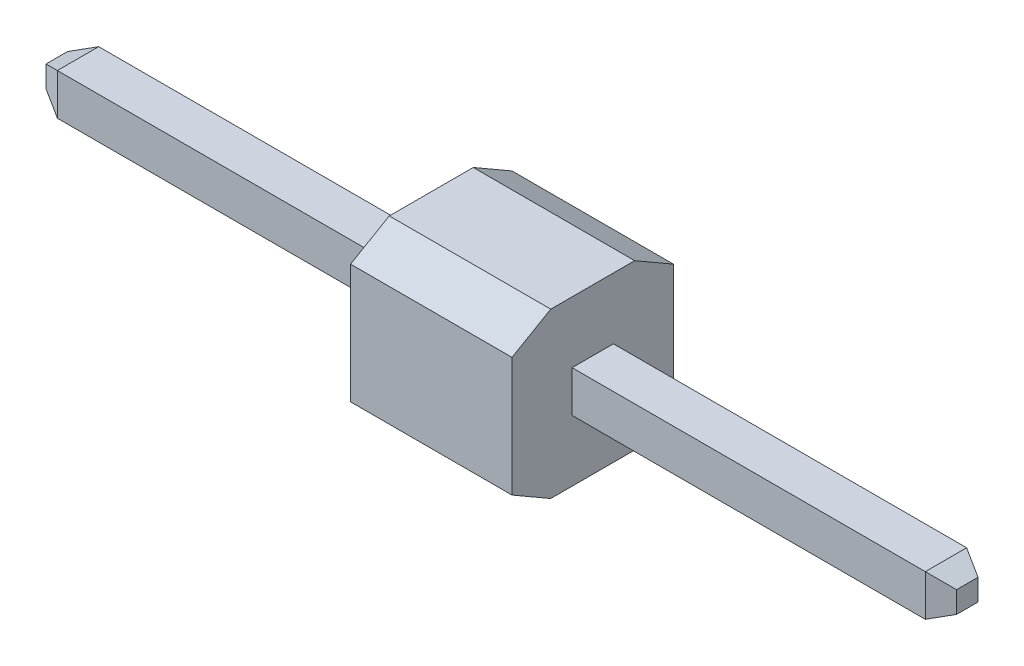
ISO-10303-21;
HEADER;
FILE_DESCRIPTION(('STEP AP214'),'2;1');
FILE_NAME('part.step','',(''),(''),'','','');
FILE_SCHEMA(('AUTOMOTIVE_DESIGN { 1 0 10303 214 1 1 1 1 }'));
ENDSEC;
DATA;
#1=APPLICATION_CONTEXT('core data for automotive mechanical design processes');
#2=APPLICATION_PROTOCOL_DEFINITION('international standard','automotive_design',2000,#1);
#3=PRODUCT_CONTEXT('',#1,'mechanical');
#4=PRODUCT('Part','Part','',(#3));
#5=PRODUCT_RELATED_PRODUCT_CATEGORY('part','',(#4));
#6=PRODUCT_DEFINITION_FORMATION('','',#4);
#7=PRODUCT_DEFINITION_CONTEXT('part definition',#1,'design');
#8=PRODUCT_DEFINITION('design','',#6,#7);
#9=PRODUCT_DEFINITION_SHAPE('','',#8);
#10=(LENGTH_UNIT() NAMED_UNIT(*) SI_UNIT(.MILLI.,.METRE.));
#11=(NAMED_UNIT(*) PLANE_ANGLE_UNIT() SI_UNIT($,.RADIAN.));
#12=(NAMED_UNIT(*) SI_UNIT($,.STERADIAN.) SOLID_ANGLE_UNIT());
#13=UNCERTAINTY_MEASURE_WITH_UNIT(LENGTH_MEASURE(1.E-05),#10,'distance_accuracy_value','');
#14=(GEOMETRIC_REPRESENTATION_CONTEXT(3) GLOBAL_UNCERTAINTY_ASSIGNED_CONTEXT((#13)) GLOBAL_UNIT_ASSIGNED_CONTEXT((#10,
#11,#12)) REPRESENTATION_CONTEXT('',''));
#15=CARTESIAN_POINT('',(0.,0.,0.));
#16=DIRECTION('',(0.,0.,1.));
#17=DIRECTION('',(1.,0.,0.));
#18=AXIS2_PLACEMENT_3D('',#15,#16,#17);
#19=CARTESIAN_POINT('',(5.421049816933,7.30287173708609,0.629998634255617));
#20=DIRECTION('',(1.,4.37113882867379E-08,-4.37113882867379E-08));
#21=DIRECTION('',(-4.37113882867379E-08,1.,0.));
#22=AXIS2_PLACEMENT_3D('',#19,#20,#21);
#23=PLANE('',#22);
#24=DIRECTION('',(1.59994790123753E-08,0.50000000000019,0.866025403784329));
#25=VECTOR('',#24,1.);
#26=CARTESIAN_POINT('',(5.42104969394708,8.54646157557208,-0.940001365744382));
#27=LINE('',#26,#25);
#28=CARTESIAN_POINT('',(5.42104969394708,8.54646157557208,-0.940001365744382));
#29=VERTEX_POINT('',#28);
#30=CARTESIAN_POINT('',(5.42104970503185,8.89287173708609,-0.340001365744383));
#31=VERTEX_POINT('',#30);
#32=EDGE_CURVE('E11',#29,#31,#27,.T.);
#33=ORIENTED_EDGE('',*,*,#32,.T.);
#34=DIRECTION('',(4.37113886966664E-08,0.,0.999999999999999));
#35=VECTOR('',#34,1.);
#36=CARTESIAN_POINT('',(5.42104970503185,8.89287173708609,-0.340001365744383));
#37=LINE('',#36,#35);
#38=CARTESIAN_POINT('',(5.42104976185665,8.89287173708609,0.959998634255618));
#39=VERTEX_POINT('',#38);
#40=EDGE_CURVE('E304',#31,#39,#37,.T.);
#41=ORIENTED_EDGE('',*,*,#40,.T.);
#42=DIRECTION('',(5.97108656004285E-08,-0.500000000000188,0.866025403784328));
#43=VECTOR('',#42,1.);
#44=CARTESIAN_POINT('',(5.42104976185665,8.89287173708609,0.959998634255618));
#45=LINE('',#44,#43);
#46=CARTESIAN_POINT('',(5.42104980322556,8.54646157557209,1.55999863425562));
#47=VERTEX_POINT('',#46);
#48=EDGE_CURVE('E296',#39,#47,#45,.T.);
#49=ORIENTED_EDGE('',*,*,#48,.T.);
#50=DIRECTION('',(4.37113884815072E-08,-0.999999999999999,0.));
#51=VECTOR('',#50,1.);
#52=CARTESIAN_POINT('',(5.42104980322556,8.54646157557209,1.55999863425562));
#53=LINE('',#52,#51);
#54=CARTESIAN_POINT('',(5.42104988396834,6.69928189860009,1.55999863425562));
#55=VERTEX_POINT('',#54);
#56=EDGE_CURVE('E281',#47,#55,#53,.T.);
#57=ORIENTED_EDGE('',*,*,#56,.T.);
#58=DIRECTION('',(1.59994777304001E-08,0.500000000000191,0.866025403784328));
#59=VECTOR('',#58,1.);
#60=CARTESIAN_POINT('',(5.42104987288358,6.35287173708609,0.959998634255618));
#61=LINE('',#60,#59);
#62=CARTESIAN_POINT('',(5.42104987288358,6.35287173708609,0.959998634255618));
#63=VERTEX_POINT('',#62);
#64=EDGE_CURVE('E265',#63,#55,#61,.T.);
#65=ORIENTED_EDGE('',*,*,#64,.F.);
#66=DIRECTION('',(4.37113886966664E-08,0.,0.999999999999999));
#67=VECTOR('',#66,1.);
#68=CARTESIAN_POINT('',(5.42104981605878,6.35287173708609,-0.340001365744383));
#69=LINE('',#68,#67);
#70=CARTESIAN_POINT('',(5.42104981605878,6.35287173708609,-0.340001365744383));
#71=VERTEX_POINT('',#70);
#72=EDGE_CURVE('E248',#71,#63,#69,.T.);
#73=ORIENTED_EDGE('',*,*,#72,.F.);
#74=DIRECTION('',(5.97108668824036E-08,-0.500000000000189,0.866025403784328));
#75=VECTOR('',#74,1.);
#76=CARTESIAN_POINT('',(5.42104977468987,6.69928189860009,-0.940001365744382));
#77=LINE('',#76,#75);
#78=CARTESIAN_POINT('',(5.42104977468987,6.69928189860009,-0.940001365744382));
#79=VERTEX_POINT('',#78);
#80=EDGE_CURVE('E242',#79,#71,#77,.T.);
#81=ORIENTED_EDGE('',*,*,#80,.F.);
#82=DIRECTION('',(4.37113884815072E-08,-0.999999999999999,0.));
#83=VECTOR('',#82,1.);
#84=CARTESIAN_POINT('',(5.42104969394708,8.54646157557208,-0.940001365744382));
#85=LINE('',#84,#83);
#86=EDGE_CURVE('E236',#29,#79,#85,.T.);
#87=ORIENTED_EDGE('',*,*,#86,.F.);
#88=EDGE_LOOP('',(#33,#41,#49,#57,#65,#73,#81,#87));
#89=FACE_BOUND('',#88,.T.);
#90=DIRECTION('',(-4.37113886753159E-08,0.,-0.999999999999999));
#91=VECTOR('',#90,1.);
#92=CARTESIAN_POINT('',(5.42104978895771,7.94287173708609,0.629998634255617));
#93=LINE('',#92,#91);
#94=CARTESIAN_POINT('',(5.42104978895771,7.94287173708609,0.629998634255617));
#95=VERTEX_POINT('',#94);
#96=CARTESIAN_POINT('',(5.42104976098243,7.94287173708609,-0.0100013657443826));
#97=VERTEX_POINT('',#96);
#98=EDGE_CURVE('E302',#95,#97,#93,.T.);
#99=ORIENTED_EDGE('',*,*,#98,.T.);
#100=DIRECTION('',(-4.3711388675316E-08,0.999999999999999,0.));
#101=VECTOR('',#100,1.);
#102=CARTESIAN_POINT('',(5.42104978895771,7.30287173708609,-0.0100013657443826));
#103=LINE('',#102,#101);
#104=CARTESIAN_POINT('',(5.42104978895771,7.30287173708609,-0.0100013657443826));
#105=VERTEX_POINT('',#104);
#106=EDGE_CURVE('E293',#105,#97,#103,.T.);
#107=ORIENTED_EDGE('',*,*,#106,.F.);
#108=DIRECTION('',(-4.37113886753159E-08,0.,-0.999999999999999));
#109=VECTOR('',#108,1.);
#110=CARTESIAN_POINT('',(5.421049816933,7.30287173708609,0.629998634255617));
#111=LINE('',#110,#109);
#112=CARTESIAN_POINT('',(5.421049816933,7.30287173708609,0.629998634255617));
#113=VERTEX_POINT('',#112);
#114=EDGE_CURVE('E278',#113,#105,#111,.T.);
#115=ORIENTED_EDGE('',*,*,#114,.F.);
#116=DIRECTION('',(-4.3711388675316E-08,0.999999999999999,0.));
#117=VECTOR('',#116,1.);
#118=CARTESIAN_POINT('',(5.421049816933,7.30287173708609,0.629998634255617));
#119=LINE('',#118,#117);
#120=EDGE_CURVE('E263',#113,#95,#119,.T.);
#121=ORIENTED_EDGE('',*,*,#120,.T.);
#122=EDGE_LOOP('',(#99,#107,#115,#121));
#123=FACE_BOUND('',#122,.T.);
#124=ADVANCED_FACE('F17',(#89,#123),#23,.T.);
#125=CARTESIAN_POINT('',(2.921049816933,7.30287162780762,0.629998743534088));
#126=DIRECTION('',(1.,4.37113882867379E-08,-4.37113882867379E-08));
#127=DIRECTION('',(-4.37113882867379E-08,1.,0.));
#128=AXIS2_PLACEMENT_3D('',#125,#126,#127);
#129=PLANE('',#128);
#130=DIRECTION('',(1.59994783713877E-08,0.50000000000019,0.866025403784329));
#131=VECTOR('',#130,1.);
#132=CARTESIAN_POINT('',(2.92104969394709,8.54646146629361,-0.940001256465912));
#133=LINE('',#132,#131);
#134=CARTESIAN_POINT('',(2.92104969394709,8.54646146629361,-0.940001256465912));
#135=VERTEX_POINT('',#134);
#136=CARTESIAN_POINT('',(2.92104970503185,8.89287162780762,-0.340001256465912));
#137=VERTEX_POINT('',#136);
#138=EDGE_CURVE('E24',#135,#137,#133,.T.);
#139=ORIENTED_EDGE('',*,*,#138,.F.);
#140=DIRECTION('',(4.37113882410924E-08,-0.999999999999999,0.));
#141=VECTOR('',#140,1.);
#142=CARTESIAN_POINT('',(2.92104969394709,8.54646146629361,-0.940001256465912));
#143=LINE('',#142,#141);
#144=CARTESIAN_POINT('',(2.92104977468987,6.69928178932161,-0.940001256465912));
#145=VERTEX_POINT('',#144);
#146=EDGE_CURVE('E300',#135,#145,#143,.T.);
#147=ORIENTED_EDGE('',*,*,#146,.T.);
#148=DIRECTION('',(5.97108668824036E-08,-0.500000000000189,0.866025403784328));
#149=VECTOR('',#148,1.);
#150=CARTESIAN_POINT('',(2.92104977468987,6.69928178932161,-0.940001256465912));
#151=LINE('',#150,#149);
#152=CARTESIAN_POINT('',(2.92104981605878,6.35287162780762,-0.340001256465912));
#153=VERTEX_POINT('',#152);
#154=EDGE_CURVE('E286',#145,#153,#151,.T.);
#155=ORIENTED_EDGE('',*,*,#154,.T.);
#156=DIRECTION('',(4.37113883550593E-08,0.,0.999999999999999));
#157=VECTOR('',#156,1.);
#158=CARTESIAN_POINT('',(2.92104981605878,6.35287162780762,-0.340001256465912));
#159=LINE('',#158,#157);
#160=CARTESIAN_POINT('',(2.92104987288358,6.35287162780762,0.959998743534088));
#161=VERTEX_POINT('',#160);
#162=EDGE_CURVE('E271',#153,#161,#159,.T.);
#163=ORIENTED_EDGE('',*,*,#162,.T.);
#164=DIRECTION('',(1.59994783713877E-08,0.500000000000191,0.866025403784328));
#165=VECTOR('',#164,1.);
#166=CARTESIAN_POINT('',(2.92104987288358,6.35287162780762,0.959998743534088));
#167=LINE('',#166,#165);
#168=CARTESIAN_POINT('',(2.92104988396834,6.69928178932162,1.55999874353409));
#169=VERTEX_POINT('',#168);
#170=EDGE_CURVE('E253',#161,#169,#167,.T.);
#171=ORIENTED_EDGE('',*,*,#170,.T.);
#172=DIRECTION('',(4.37113882410924E-08,-0.999999999999999,0.));
#173=VECTOR('',#172,1.);
#174=CARTESIAN_POINT('',(2.92104980322556,8.54646146629362,1.55999874353409));
#175=LINE('',#174,#173);
#176=CARTESIAN_POINT('',(2.92104980322556,8.54646146629362,1.55999874353409));
#177=VERTEX_POINT('',#176);
#178=EDGE_CURVE('E261',#177,#169,#175,.T.);
#179=ORIENTED_EDGE('',*,*,#178,.F.);
#180=DIRECTION('',(5.97108668824036E-08,-0.500000000000188,0.866025403784328));
#181=VECTOR('',#180,1.);
#182=CARTESIAN_POINT('',(2.92104976185665,8.89287162780762,0.959998743534088));
#183=LINE('',#182,#181);
#184=CARTESIAN_POINT('',(2.92104976185665,8.89287162780762,0.959998743534088));
#185=VERTEX_POINT('',#184);
#186=EDGE_CURVE('E276',#185,#177,#183,.T.);
#187=ORIENTED_EDGE('',*,*,#186,.F.);
#188=DIRECTION('',(4.37113883550593E-08,0.,0.999999999999999));
#189=VECTOR('',#188,1.);
#190=CARTESIAN_POINT('',(2.92104970503185,8.89287162780762,-0.340001256465912));
#191=LINE('',#190,#189);
#192=EDGE_CURVE('E291',#137,#185,#191,.T.);
#193=ORIENTED_EDGE('',*,*,#192,.F.);
#194=EDGE_LOOP('',(#139,#147,#155,#163,#171,#179,#187,#193));
#195=FACE_BOUND('',#194,.T.);
#196=DIRECTION('',(-4.37113879814266E-08,0.999999999999999,0.));
#197=VECTOR('',#196,1.);
#198=CARTESIAN_POINT('',(2.92104978895771,7.30287162780762,-0.0100012564659119));
#199=LINE('',#198,#197);
#200=CARTESIAN_POINT('',(2.92104978895771,7.30287162780762,-0.0100012564659119));
#201=VERTEX_POINT('',#200);
#202=CARTESIAN_POINT('',(2.92104976098243,7.94287162780762,-0.0100012564659119));
#203=VERTEX_POINT('',#202);
#204=EDGE_CURVE('E298',#201,#203,#199,.T.);
#205=ORIENTED_EDGE('',*,*,#204,.T.);
#206=DIRECTION('',(-4.37113879814266E-08,0.,-0.999999999999999));
#207=VECTOR('',#206,1.);
#208=CARTESIAN_POINT('',(2.92104978895771,7.94287162780762,0.629998743534088));
#209=LINE('',#208,#207);
#210=CARTESIAN_POINT('',(2.92104978895771,7.94287162780762,0.629998743534088));
#211=VERTEX_POINT('',#210);
#212=EDGE_CURVE('E283',#211,#203,#209,.T.);
#213=ORIENTED_EDGE('',*,*,#212,.F.);
#214=DIRECTION('',(-4.3711388675316E-08,0.999999999999999,0.));
#215=VECTOR('',#214,1.);
#216=CARTESIAN_POINT('',(2.921049816933,7.30287162780762,0.629998743534088));
#217=LINE('',#216,#215);
#218=CARTESIAN_POINT('',(2.921049816933,7.30287162780762,0.629998743534088));
#219=VERTEX_POINT('',#218);
#220=EDGE_CURVE('E268',#219,#211,#217,.T.);
#221=ORIENTED_EDGE('',*,*,#220,.F.);
#222=DIRECTION('',(-4.37113886753159E-08,0.,-0.999999999999999));
#223=VECTOR('',#222,1.);
#224=CARTESIAN_POINT('',(2.921049816933,7.30287162780762,0.629998743534088));
#225=LINE('',#224,#223);
#226=EDGE_CURVE('E251',#219,#201,#225,.T.);
#227=ORIENTED_EDGE('',*,*,#226,.T.);
#228=EDGE_LOOP('',(#205,#213,#221,#227));
#229=FACE_BOUND('',#228,.T.);
#230=ADVANCED_FACE('F314',(#195,#229),#129,.F.);
#231=CARTESIAN_POINT('',(5.42104969394708,8.54646157557208,-0.940001365744382));
#232=DIRECTION('',(5.97108668343731E-08,-0.866025403784328,0.50000000000019));
#233=DIRECTION('',(-1.59994785476185E-08,-0.500000000000192,-0.866025403784329));
#234=AXIS2_PLACEMENT_3D('',#231,#232,#233);
#235=PLANE('',#234);
#236=ORIENTED_EDGE('',*,*,#138,.T.);
#237=DIRECTION('',(-0.999999999999998,-4.37113882867378E-08,4.37113883755557E-08));
#238=VECTOR('',#237,1.);
#239=CARTESIAN_POINT('',(5.42104970503185,8.89287173708609,-0.340001365744383));
#240=LINE('',#239,#238);
#241=EDGE_CURVE('E288',#31,#137,#240,.T.);
#242=ORIENTED_EDGE('',*,*,#241,.F.);
#243=ORIENTED_EDGE('',*,*,#32,.F.);
#244=DIRECTION('',(-0.999999999999998,-4.37113882867378E-08,4.37113881091022E-08));
#245=VECTOR('',#244,1.);
#246=CARTESIAN_POINT('',(5.42104969394708,8.54646157557208,-0.940001365744382));
#247=LINE('',#246,#245);
#248=EDGE_CURVE('E256',#29,#135,#247,.T.);
#249=ORIENTED_EDGE('',*,*,#248,.T.);
#250=EDGE_LOOP('',(#236,#242,#243,#249));
#251=FACE_BOUND('',#250,.T.);
#252=ADVANCED_FACE('F306',(#251),#235,.F.);
#253=CARTESIAN_POINT('',(5.42104970503185,8.89287173708609,-0.340001365744383));
#254=DIRECTION('',(4.37113882867379E-08,-1.,0.));
#255=DIRECTION('',(1.,4.37113882867379E-08,-4.37113882867379E-08));
#256=AXIS2_PLACEMENT_3D('',#253,#254,#255);
#257=PLANE('',#256);
#258=ORIENTED_EDGE('',*,*,#192,.T.);
#259=DIRECTION('',(-0.999999999999998,-4.37113882867378E-08,4.37113882867378E-08));
#260=VECTOR('',#259,1.);
#261=CARTESIAN_POINT('',(5.42104976185665,8.89287173708609,0.959998634255618));
#262=LINE('',#261,#260);
#263=EDGE_CURVE('E273',#39,#185,#262,.T.);
#264=ORIENTED_EDGE('',*,*,#263,.F.);
#265=ORIENTED_EDGE('',*,*,#40,.F.);
#266=ORIENTED_EDGE('',*,*,#241,.T.);
#267=EDGE_LOOP('',(#258,#264,#265,#266));
#268=FACE_BOUND('',#267,.T.);
#269=ADVANCED_FACE('F311',(#268),#257,.F.);
#270=CARTESIAN_POINT('',(5.42104976185665,8.89287173708609,0.959998634255618));
#271=DIRECTION('',(1.59994785476185E-08,-0.86602540378433,-0.50000000000019));
#272=DIRECTION('',(-5.97108668343731E-08,0.500000000000188,-0.866025403784329));
#273=AXIS2_PLACEMENT_3D('',#270,#271,#272);
#274=PLANE('',#273);
#275=ORIENTED_EDGE('',*,*,#186,.T.);
#276=DIRECTION('',(-0.999999999999998,-4.37113875761951E-08,4.37113882867378E-08));
#277=VECTOR('',#276,1.);
#278=CARTESIAN_POINT('',(5.42104980322556,8.54646157557209,1.55999863425562));
#279=LINE('',#278,#277);
#280=EDGE_CURVE('E258',#47,#177,#279,.T.);
#281=ORIENTED_EDGE('',*,*,#280,.F.);
#282=ORIENTED_EDGE('',*,*,#48,.F.);
#283=ORIENTED_EDGE('',*,*,#263,.T.);
#284=EDGE_LOOP('',(#275,#281,#282,#283));
#285=FACE_BOUND('',#284,.T.);
#286=ADVANCED_FACE('F319',(#285),#274,.F.);
#287=CARTESIAN_POINT('',(5.42104980322556,8.54646157557209,1.55999863425562));
#288=DIRECTION('',(-4.37113882867379E-08,0.,-1.));
#289=DIRECTION('',(-1.,-4.37113882867379E-08,4.37113882867379E-08));
#290=AXIS2_PLACEMENT_3D('',#287,#288,#289);
#291=PLANE('',#290);
#292=ORIENTED_EDGE('',*,*,#178,.T.);
#293=DIRECTION('',(-0.999999999999998,-4.37113882867378E-08,4.37113882867378E-08));
#294=VECTOR('',#293,1.);
#295=CARTESIAN_POINT('',(5.42104988396834,6.69928189860009,1.55999863425562));
#296=LINE('',#295,#294);
#297=EDGE_CURVE('E245',#55,#169,#296,.T.);
#298=ORIENTED_EDGE('',*,*,#297,.F.);
#299=ORIENTED_EDGE('',*,*,#56,.F.);
#300=ORIENTED_EDGE('',*,*,#280,.T.);
#301=EDGE_LOOP('',(#292,#298,#299,#300));
#302=FACE_BOUND('',#301,.T.);
#303=ADVANCED_FACE('F326',(#302),#291,.F.);
#304=CARTESIAN_POINT('',(5.42104987288358,6.35287173708609,0.959998634255618));
#305=DIRECTION('',(5.97108668343731E-08,-0.866025403784328,0.50000000000019));
#306=DIRECTION('',(-1.59994785476185E-08,-0.500000000000192,-0.866025403784329));
#307=AXIS2_PLACEMENT_3D('',#304,#305,#306);
#308=PLANE('',#307);
#309=ORIENTED_EDGE('',*,*,#170,.F.);
#310=DIRECTION('',(-0.999999999999998,-4.37113886420092E-08,4.37113882867378E-08));
#311=VECTOR('',#310,1.);
#312=CARTESIAN_POINT('',(5.42104987288358,6.35287173708609,0.959998634255618));
#313=LINE('',#312,#311);
#314=EDGE_CURVE('E239',#63,#161,#313,.T.);
#315=ORIENTED_EDGE('',*,*,#314,.F.);
#316=ORIENTED_EDGE('',*,*,#64,.T.);
#317=ORIENTED_EDGE('',*,*,#297,.T.);
#318=EDGE_LOOP('',(#309,#315,#316,#317));
#319=FACE_BOUND('',#318,.T.);
#320=ADVANCED_FACE('F329',(#319),#308,.T.);
#321=CARTESIAN_POINT('',(5.42104981605878,6.35287173708609,-0.340001365744383));
#322=DIRECTION('',(4.37113882867379E-08,-1.,0.));
#323=DIRECTION('',(1.,4.37113882867379E-08,-4.37113882867379E-08));
#324=AXIS2_PLACEMENT_3D('',#321,#322,#323);
#325=PLANE('',#324);
#326=ORIENTED_EDGE('',*,*,#162,.F.);
#327=DIRECTION('',(-0.999999999999998,-4.37113886420092E-08,4.37113883755557E-08));
#328=VECTOR('',#327,1.);
#329=CARTESIAN_POINT('',(5.42104981605878,6.35287173708609,-0.340001365744383));
#330=LINE('',#329,#328);
#331=EDGE_CURVE('E233',#71,#153,#330,.T.);
#332=ORIENTED_EDGE('',*,*,#331,.F.);
#333=ORIENTED_EDGE('',*,*,#72,.T.);
#334=ORIENTED_EDGE('',*,*,#314,.T.);
#335=EDGE_LOOP('',(#326,#332,#333,#334));
#336=FACE_BOUND('',#335,.T.);
#337=ADVANCED_FACE('F333',(#336),#325,.T.);
#338=CARTESIAN_POINT('',(5.42104977468987,6.69928189860009,-0.940001365744382));
#339=DIRECTION('',(1.59994785476185E-08,-0.86602540378433,-0.50000000000019));
#340=DIRECTION('',(-5.97108668343731E-08,0.500000000000188,-0.866025403784329));
#341=AXIS2_PLACEMENT_3D('',#338,#339,#340);
#342=PLANE('',#341);
#343=ORIENTED_EDGE('',*,*,#154,.F.);
#344=DIRECTION('',(-0.999999999999998,-4.37113882867378E-08,4.37113881091022E-08));
#345=VECTOR('',#344,1.);
#346=CARTESIAN_POINT('',(5.42104977468987,6.69928189860009,-0.940001365744382));
#347=LINE('',#346,#345);
#348=EDGE_CURVE('E230',#79,#145,#347,.T.);
#349=ORIENTED_EDGE('',*,*,#348,.F.);
#350=ORIENTED_EDGE('',*,*,#80,.T.);
#351=ORIENTED_EDGE('',*,*,#331,.T.);
#352=EDGE_LOOP('',(#343,#349,#350,#351));
#353=FACE_BOUND('',#352,.T.);
#354=ADVANCED_FACE('F337',(#353),#342,.T.);
#355=CARTESIAN_POINT('',(5.42104969394708,8.54646157557208,-0.940001365744382));
#356=DIRECTION('',(-4.37113882867379E-08,0.,-1.));
#357=DIRECTION('',(-4.37113882867379E-08,1.,0.));
#358=AXIS2_PLACEMENT_3D('',#355,#356,#357);
#359=PLANE('',#358);
#360=ORIENTED_EDGE('',*,*,#146,.F.);
#361=ORIENTED_EDGE('',*,*,#248,.F.);
#362=ORIENTED_EDGE('',*,*,#86,.T.);
#363=ORIENTED_EDGE('',*,*,#348,.T.);
#364=EDGE_LOOP('',(#360,#361,#362,#363));
#365=FACE_BOUND('',#364,.T.);
#366=ADVANCED_FACE('F339',(#365),#359,.T.);
#367=CARTESIAN_POINT('',(-2.878950183067,7.30287137428157,0.62999899706014));
#368=DIRECTION('',(-1.,-4.37113882867379E-08,4.37113882867379E-08));
#369=DIRECTION('',(4.37113882867379E-08,-1.,0.));
#370=AXIS2_PLACEMENT_3D('',#367,#368,#369);
#371=PLANE('',#370);
#372=DIRECTION('',(4.37113847280434E-08,-0.999999999999999,0.));
#373=VECTOR('',#372,1.);
#374=CARTESIAN_POINT('',(-2.87895022556482,7.78898984709056,0.14388052425114));
#375=LINE('',#374,#373);
#376=CARTESIAN_POINT('',(-2.87895022556482,7.78898984709056,0.14388052425114));
#377=VERTEX_POINT('',#376);
#378=CARTESIAN_POINT('',(-2.87895021104229,7.45675290147256,0.14388052425114));
#379=VERTEX_POINT('',#378);
#380=EDGE_CURVE('E228',#377,#379,#375,.T.);
#381=ORIENTED_EDGE('',*,*,#380,.T.);
#382=DIRECTION('',(4.37113874013716E-08,0.,0.999999999999999));
#383=VECTOR('',#382,1.);
#384=CARTESIAN_POINT('',(-2.87895021104229,7.45675290147256,0.14388052425114));
#385=LINE('',#384,#383);
#386=CARTESIAN_POINT('',(-2.87895019651975,7.45675290147257,0.47611746986914));
#387=VERTEX_POINT('',#386);
#388=EDGE_CURVE('E223',#379,#387,#385,.T.);
#389=ORIENTED_EDGE('',*,*,#388,.T.);
#390=DIRECTION('',(-4.37113900746999E-08,0.999999999999999,0.));
#391=VECTOR('',#390,1.);
#392=CARTESIAN_POINT('',(-2.87895019651975,7.45675290147257,0.47611746986914));
#393=LINE('',#392,#391);
#394=CARTESIAN_POINT('',(-2.87895021104229,7.78898984709057,0.47611746986914));
#395=VERTEX_POINT('',#394);
#396=EDGE_CURVE('E215',#387,#395,#393,.T.);
#397=ORIENTED_EDGE('',*,*,#396,.T.);
#398=DIRECTION('',(-4.37113820547151E-08,0.,-0.999999999999999));
#399=VECTOR('',#398,1.);
#400=CARTESIAN_POINT('',(-2.87895021104229,7.78898984709057,0.47611746986914));
#401=LINE('',#400,#399);
#402=EDGE_CURVE('E207',#395,#377,#401,.T.);
#403=ORIENTED_EDGE('',*,*,#402,.T.);
#404=EDGE_LOOP('',(#381,#389,#397,#403));
#405=FACE_BOUND('',#404,.T.);
#406=ADVANCED_FACE('F341',(#405),#371,.T.);
#407=CARTESIAN_POINT('',(-2.878950183067,7.30287137428157,0.62999899706014));
#408=DIRECTION('',(4.37113882867379E-08,-1.,0.));
#409=DIRECTION('',(-4.37113882867379E-08,0.,-1.));
#410=AXIS2_PLACEMENT_3D('',#407,#408,#409);
#411=PLANE('',#410);
#412=DIRECTION('',(0.999999999999998,4.37113886829271E-08,-4.37113882769955E-08));
#413=VECTOR('',#412,1.);
#414=CARTESIAN_POINT('',(-2.548950183067,7.30287138870632,0.629998982635382));
#415=LINE('',#414,#413);
#416=CARTESIAN_POINT('',(-2.548950183067,7.30287138870632,0.629998982635382));
#417=VERTEX_POINT('',#416);
#418=EDGE_CURVE('E225',#417,#219,#415,.T.);
#419=ORIENTED_EDGE('',*,*,#418,.F.);
#420=DIRECTION('',(-4.37113886753159E-08,0.,-0.999999999999999));
#421=VECTOR('',#420,1.);
#422=CARTESIAN_POINT('',(-2.548950183067,7.30287138870632,0.629998982635382));
#423=LINE('',#422,#421);
#424=CARTESIAN_POINT('',(-2.54895021104229,7.30287138870632,-0.010001017364618));
#425=VERTEX_POINT('',#424);
#426=EDGE_CURVE('E217',#417,#425,#423,.T.);
#427=ORIENTED_EDGE('',*,*,#426,.T.);
#428=DIRECTION('',(0.999999999999998,4.37113886829271E-08,-4.37113882161057E-08));
#429=VECTOR('',#428,1.);
#430=CARTESIAN_POINT('',(-2.54895021104229,7.30287138870632,-0.010001017364618));
#431=LINE('',#430,#429);
#432=EDGE_CURVE('E220',#425,#201,#431,.T.);
#433=ORIENTED_EDGE('',*,*,#432,.T.);
#434=ORIENTED_EDGE('',*,*,#226,.F.);
#435=EDGE_LOOP('',(#419,#427,#433,#434));
#436=FACE_BOUND('',#435,.T.);
#437=ADVANCED_FACE('F348',(#436),#411,.T.);
#438=CARTESIAN_POINT('',(-2.87895021104229,7.30287137428156,-0.0100010029398598));
#439=DIRECTION('',(-4.37113882867379E-08,0.,-1.));
#440=DIRECTION('',(-1.,-4.37113882867379E-08,4.37113882867379E-08));
#441=AXIS2_PLACEMENT_3D('',#438,#439,#440);
#442=PLANE('',#441);
#443=ORIENTED_EDGE('',*,*,#432,.F.);
#444=DIRECTION('',(-4.3711388675316E-08,0.999999999999999,0.));
#445=VECTOR('',#444,1.);
#446=CARTESIAN_POINT('',(-2.54895021104229,7.30287138870632,-0.010001017364618));
#447=LINE('',#446,#445);
#448=CARTESIAN_POINT('',(-2.54895023901757,7.94287138870632,-0.010001017364618));
#449=VERTEX_POINT('',#448);
#450=EDGE_CURVE('E209',#425,#449,#447,.T.);
#451=ORIENTED_EDGE('',*,*,#450,.T.);
#452=DIRECTION('',(0.999999999999998,4.37113881958092E-08,-4.37113882161057E-08));
#453=VECTOR('',#452,1.);
#454=CARTESIAN_POINT('',(-2.54895023901757,7.94287138870632,-0.010001017364618));
#455=LINE('',#454,#453);
#456=EDGE_CURVE('E212',#449,#203,#455,.T.);
#457=ORIENTED_EDGE('',*,*,#456,.T.);
#458=ORIENTED_EDGE('',*,*,#204,.F.);
#459=EDGE_LOOP('',(#443,#451,#457,#458));
#460=FACE_BOUND('',#459,.T.);
#461=ADVANCED_FACE('F424',(#460),#442,.T.);
#462=CARTESIAN_POINT('',(-2.87895021104229,7.94287137428156,0.62999899706014));
#463=DIRECTION('',(4.37113882867379E-08,-1.,0.));
#464=DIRECTION('',(-4.37113882867379E-08,0.,-1.));
#465=AXIS2_PLACEMENT_3D('',#462,#463,#464);
#466=PLANE('',#465);
#467=ORIENTED_EDGE('',*,*,#456,.F.);
#468=DIRECTION('',(4.37113900630947E-08,0.,0.999999999999999));
#469=VECTOR('',#468,1.);
#470=CARTESIAN_POINT('',(-2.54895023901758,7.94287138870632,-0.010001017364618));
#471=LINE('',#470,#469);
#472=CARTESIAN_POINT('',(-2.54895021104229,7.94287138870632,0.629998982635382));
#473=VERTEX_POINT('',#472);
#474=EDGE_CURVE('E201',#449,#473,#471,.T.);
#475=ORIENTED_EDGE('',*,*,#474,.T.);
#476=DIRECTION('',(0.999999999999998,4.37113881958092E-08,-4.37113882769955E-08));
#477=VECTOR('',#476,1.);
#478=CARTESIAN_POINT('',(-2.54895021104229,7.94287138870632,0.629998982635382));
#479=LINE('',#478,#477);
#480=EDGE_CURVE('E204',#473,#211,#479,.T.);
#481=ORIENTED_EDGE('',*,*,#480,.T.);
#482=ORIENTED_EDGE('',*,*,#212,.T.);
#483=EDGE_LOOP('',(#467,#475,#481,#482));
#484=FACE_BOUND('',#483,.T.);
#485=ADVANCED_FACE('F421',(#484),#466,.F.);
#486=CARTESIAN_POINT('',(-2.878950183067,7.30287137428157,0.62999899706014));
#487=DIRECTION('',(-4.37113882867379E-08,0.,-1.));
#488=DIRECTION('',(-1.,-4.37113882867379E-08,4.37113882867379E-08));
#489=AXIS2_PLACEMENT_3D('',#486,#487,#488);
#490=PLANE('',#489);
#491=ORIENTED_EDGE('',*,*,#480,.F.);
#492=DIRECTION('',(4.37113872875372E-08,-0.999999999999999,0.));
#493=VECTOR('',#492,1.);
#494=CARTESIAN_POINT('',(-2.54895021104228,7.94287138870632,0.629998982635382));
#495=LINE('',#494,#493);
#496=EDGE_CURVE('E196',#473,#417,#495,.T.);
#497=ORIENTED_EDGE('',*,*,#496,.T.);
#498=ORIENTED_EDGE('',*,*,#418,.T.);
#499=ORIENTED_EDGE('',*,*,#220,.T.);
#500=EDGE_LOOP('',(#491,#497,#498,#499));
#501=FACE_BOUND('',#500,.T.);
#502=ADVANCED_FACE('F376',(#501),#490,.F.);
#503=CARTESIAN_POINT('',(-2.878950183067,7.30287137428157,0.62999899706014));
#504=DIRECTION('',(-4.37113882867379E-08,0.,-1.));
#505=DIRECTION('',(-1.,-4.37113882867379E-08,4.37113882867379E-08));
#506=AXIS2_PLACEMENT_3D('',#503,#504,#505);
#507=PLANE('',#506);
#508=DIRECTION('',(0.999999999999998,4.37113883581818E-08,-4.37113882769955E-08));
#509=VECTOR('',#508,1.);
#510=CARTESIAN_POINT('',(5.421049816933,7.30287173708609,0.629998634255617));
#511=LINE('',#510,#509);
#512=CARTESIAN_POINT('',(10.891049816933,7.30287197618738,0.629998395154324));
#513=VERTEX_POINT('',#512);
#514=EDGE_CURVE('E199',#113,#513,#511,.T.);
#515=ORIENTED_EDGE('',*,*,#514,.T.);
#516=DIRECTION('',(-4.37113900630947E-08,0.999999999999999,0.));
#517=VECTOR('',#516,1.);
#518=CARTESIAN_POINT('',(10.891049816933,7.30287197618738,0.629998395154324));
#519=LINE('',#518,#517);
#520=CARTESIAN_POINT('',(10.8910497889577,7.94287197618738,0.629998395154324));
#521=VERTEX_POINT('',#520);
#522=EDGE_CURVE('E191',#513,#521,#519,.T.);
#523=ORIENTED_EDGE('',*,*,#522,.T.);
#524=DIRECTION('',(0.999999999999998,4.37113883581818E-08,-4.37113882769955E-08));
#525=VECTOR('',#524,1.);
#526=CARTESIAN_POINT('',(5.42104978895771,7.94287173708609,0.629998634255617));
#527=LINE('',#526,#525);
#528=EDGE_CURVE('E194',#95,#521,#527,.T.);
#529=ORIENTED_EDGE('',*,*,#528,.F.);
#530=ORIENTED_EDGE('',*,*,#120,.F.);
#531=EDGE_LOOP('',(#515,#523,#529,#530));
#532=FACE_BOUND('',#531,.T.);
#533=ADVANCED_FACE('F367',(#532),#507,.F.);
#534=CARTESIAN_POINT('',(-2.87895021104229,7.94287137428156,0.62999899706014));
#535=DIRECTION('',(4.37113882867379E-08,-1.,0.));
#536=DIRECTION('',(-4.37113882867379E-08,0.,-1.));
#537=AXIS2_PLACEMENT_3D('',#534,#535,#536);
#538=PLANE('',#537);
#539=ORIENTED_EDGE('',*,*,#528,.T.);
#540=DIRECTION('',(-4.37113900630947E-08,0.,-0.999999999999999));
#541=VECTOR('',#540,1.);
#542=CARTESIAN_POINT('',(10.8910497889577,7.94287197618738,0.629998395154324));
#543=LINE('',#542,#541);
#544=CARTESIAN_POINT('',(10.8910497609824,7.94287197618738,-0.0100016048456765));
#545=VERTEX_POINT('',#544);
#546=EDGE_CURVE('E186',#521,#545,#543,.T.);
#547=ORIENTED_EDGE('',*,*,#546,.T.);
#548=DIRECTION('',(0.999999999999998,4.37113883581818E-08,-4.37113881146228E-08));
#549=VECTOR('',#548,1.);
#550=CARTESIAN_POINT('',(5.42104976098243,7.94287173708609,-0.0100013657443823));
#551=LINE('',#550,#549);
#552=EDGE_CURVE('E189',#97,#545,#551,.T.);
#553=ORIENTED_EDGE('',*,*,#552,.F.);
#554=ORIENTED_EDGE('',*,*,#98,.F.);
#555=EDGE_LOOP('',(#539,#547,#553,#554));
#556=FACE_BOUND('',#555,.T.);
#557=ADVANCED_FACE('F364',(#556),#538,.F.);
#558=CARTESIAN_POINT('',(-2.87895021104229,7.30287137428156,-0.0100010029398598));
#559=DIRECTION('',(-4.37113882867379E-08,0.,-1.));
#560=DIRECTION('',(-1.,-4.37113882867379E-08,4.37113882867379E-08));
#561=AXIS2_PLACEMENT_3D('',#558,#559,#560);
#562=PLANE('',#561);
#563=ORIENTED_EDGE('',*,*,#552,.T.);
#564=DIRECTION('',(4.37113872875372E-08,-0.999999999999999,0.));
#565=VECTOR('',#564,1.);
#566=CARTESIAN_POINT('',(10.8910497609824,7.94287197618738,-0.0100016048456766));
#567=LINE('',#566,#565);
#568=CARTESIAN_POINT('',(10.8910497889577,7.30287197618738,-0.0100016048456765));
#569=VERTEX_POINT('',#568);
#570=EDGE_CURVE('E176',#545,#569,#567,.T.);
#571=ORIENTED_EDGE('',*,*,#570,.T.);
#572=DIRECTION('',(0.999999999999998,4.37113883581818E-08,-4.37113881146228E-08));
#573=VECTOR('',#572,1.);
#574=CARTESIAN_POINT('',(5.42104978895771,7.30287173708609,-0.0100013657443823));
#575=LINE('',#574,#573);
#576=EDGE_CURVE('E179',#105,#569,#575,.T.);
#577=ORIENTED_EDGE('',*,*,#576,.F.);
#578=ORIENTED_EDGE('',*,*,#106,.T.);
#579=EDGE_LOOP('',(#563,#571,#577,#578));
#580=FACE_BOUND('',#579,.T.);
#581=ADVANCED_FACE('F366',(#580),#562,.T.);
#582=CARTESIAN_POINT('',(-2.878950183067,7.30287137428157,0.62999899706014));
#583=DIRECTION('',(4.37113882867379E-08,-1.,0.));
#584=DIRECTION('',(-4.37113882867379E-08,0.,-1.));
#585=AXIS2_PLACEMENT_3D('',#582,#583,#584);
#586=PLANE('',#585);
#587=ORIENTED_EDGE('',*,*,#576,.T.);
#588=DIRECTION('',(4.37113845119796E-08,0.,0.999999999999999));
#589=VECTOR('',#588,1.);
#590=CARTESIAN_POINT('',(10.8910497889577,7.30287197618738,-0.0100016048456765));
#591=LINE('',#590,#589);
#592=EDGE_CURVE('E167',#569,#513,#591,.T.);
#593=ORIENTED_EDGE('',*,*,#592,.T.);
#594=ORIENTED_EDGE('',*,*,#514,.F.);
#595=ORIENTED_EDGE('',*,*,#114,.T.);
#596=EDGE_LOOP('',(#587,#593,#594,#595));
#597=FACE_BOUND('',#596,.T.);
#598=ADVANCED_FACE('F373',(#597),#586,.T.);
#599=CARTESIAN_POINT('',(11.221049816933,7.30287199061214,0.629998380729565));
#600=DIRECTION('',(-1.,-4.37113882867379E-08,4.37113882867379E-08));
#601=DIRECTION('',(4.37113882867379E-08,-1.,0.));
#602=AXIS2_PLACEMENT_3D('',#599,#600,#601);
#603=PLANE('',#602);
#604=DIRECTION('',(-4.37113927480282E-08,0.999999999999999,0.));
#605=VECTOR('',#604,1.);
#606=CARTESIAN_POINT('',(11.2210497889577,7.45675351780314,0.143879907920565));
#607=LINE('',#606,#605);
#608=CARTESIAN_POINT('',(11.2210497889577,7.45675351780314,0.143879907920565));
#609=VERTEX_POINT('',#608);
#610=CARTESIAN_POINT('',(11.2210497744352,7.78899046342114,0.143879907920565));
#611=VERTEX_POINT('',#610);
#612=EDGE_CURVE('E153',#609,#611,#607,.T.);
#613=ORIENTED_EDGE('',*,*,#612,.T.);
#614=DIRECTION('',(4.37113927480282E-08,0.,0.999999999999999));
#615=VECTOR('',#614,1.);
#616=CARTESIAN_POINT('',(11.2210497744352,7.78899046342114,0.143879907920565));
#617=LINE('',#616,#615);
#618=CARTESIAN_POINT('',(11.2210497889577,7.78899046342114,0.476116853538565));
#619=VERTEX_POINT('',#618);
#620=EDGE_CURVE('E395',#611,#619,#617,.T.);
#621=ORIENTED_EDGE('',*,*,#620,.T.);
#622=DIRECTION('',(4.37113874013716E-08,-0.999999999999999,0.));
#623=VECTOR('',#622,1.);
#624=CARTESIAN_POINT('',(11.2210497889577,7.78899046342114,0.476116853538565));
#625=LINE('',#624,#623);
#626=CARTESIAN_POINT('',(11.2210498034803,7.45675351780314,0.476116853538565));
#627=VERTEX_POINT('',#626);
#628=EDGE_CURVE('E156',#619,#627,#625,.T.);
#629=ORIENTED_EDGE('',*,*,#628,.T.);
#630=DIRECTION('',(-4.37113927480282E-08,0.,-0.999999999999999));
#631=VECTOR('',#630,1.);
#632=CARTESIAN_POINT('',(11.2210498034803,7.45675351780314,0.476116853538565));
#633=LINE('',#632,#631);
#634=EDGE_CURVE('E149',#627,#609,#633,.T.);
#635=ORIENTED_EDGE('',*,*,#634,.T.);
#636=EDGE_LOOP('',(#613,#621,#629,#635));
#637=FACE_BOUND('',#636,.T.);
#638=ADVANCED_FACE('F151',(#637),#603,.F.);
#639=CARTESIAN_POINT('',(-2.87895020431591,7.78898984709057,0.62999899706014));
#640=DIRECTION('',(-0.422618301356784,0.906307768563367,1.84732310895534E-08));
#641=DIRECTION('',(4.37113882867379E-08,0.,1.));
#642=AXIS2_PLACEMENT_3D('',#639,#640,#641);
#643=PLANE('',#642);
#644=DIRECTION('',(0.834817095446926,0.389281657126018,-0.389281657126018));
#645=VECTOR('',#644,1.);
#646=CARTESIAN_POINT('',(-2.87895022556452,7.78898984709023,0.143880524251471));
#647=LINE('',#646,#645);
#648=EDGE_CURVE('E181',#377,#449,#647,.T.);
#649=ORIENTED_EDGE('',*,*,#648,.F.);
#650=ORIENTED_EDGE('',*,*,#402,.F.);
#651=DIRECTION('',(-0.834817129479007,-0.389281657126017,-0.389281584143988));
#652=VECTOR('',#651,1.);
#653=CARTESIAN_POINT('',(-2.54895021104207,7.94287138870609,0.629998982635147));
#654=LINE('',#653,#652);
#655=EDGE_CURVE('E404',#473,#395,#654,.T.);
#656=ORIENTED_EDGE('',*,*,#655,.F.);
#657=ORIENTED_EDGE('',*,*,#474,.F.);
#658=EDGE_LOOP('',(#649,#650,#656,#657));
#659=FACE_BOUND('',#658,.T.);
#660=ADVANCED_FACE('F418',(#659),#643,.T.);
#661=CARTESIAN_POINT('',(-2.87895018979337,7.30287137428157,0.47611746986914));
#662=DIRECTION('',(-0.422618222124841,-1.84732292043498E-08,0.906307805509828));
#663=DIRECTION('',(4.37113882867379E-08,-1.,0.));
#664=AXIS2_PLACEMENT_3D('',#661,#662,#663);
#665=PLANE('',#664);
#666=ORIENTED_EDGE('',*,*,#655,.T.);
#667=ORIENTED_EDGE('',*,*,#396,.F.);
#668=DIRECTION('',(-0.834817163511087,0.389281584143987,-0.389281584143986));
#669=VECTOR('',#668,1.);
#670=CARTESIAN_POINT('',(-2.54895018306683,7.30287138870651,0.629998982635199));
#671=LINE('',#670,#669);
#672=EDGE_CURVE('E160',#417,#387,#671,.T.);
#673=ORIENTED_EDGE('',*,*,#672,.F.);
#674=ORIENTED_EDGE('',*,*,#496,.F.);
#675=EDGE_LOOP('',(#666,#667,#673,#674));
#676=FACE_BOUND('',#675,.T.);
#677=ADVANCED_FACE('F434',(#676),#665,.T.);
#678=CARTESIAN_POINT('',(-2.54895021104229,7.30287138870632,-0.010001017364618));
#679=DIRECTION('',(0.422618301356784,1.8473232667688E-08,0.906307768563367));
#680=DIRECTION('',(-4.37113882867379E-08,1.,0.));
#681=AXIS2_PLACEMENT_3D('',#678,#679,#680);
#682=PLANE('',#681);
#683=ORIENTED_EDGE('',*,*,#648,.T.);
#684=ORIENTED_EDGE('',*,*,#450,.F.);
#685=DIRECTION('',(0.834817129479007,-0.389281584143986,-0.389281657126019));
#686=VECTOR('',#685,1.);
#687=CARTESIAN_POINT('',(-2.8789502110422,7.45675290147266,0.143880524251236));
#688=LINE('',#687,#686);
#689=EDGE_CURVE('E170',#379,#425,#688,.T.);
#690=ORIENTED_EDGE('',*,*,#689,.F.);
#691=ORIENTED_EDGE('',*,*,#380,.F.);
#692=EDGE_LOOP('',(#683,#684,#690,#691));
#693=FACE_BOUND('',#692,.T.);
#694=ADVANCED_FACE('F413',(#693),#682,.F.);
#695=CARTESIAN_POINT('',(-2.548950183067,7.30287138870632,0.629998982635382));
#696=DIRECTION('',(0.422618222124841,0.906307805509828,-1.84732308250282E-08));
#697=DIRECTION('',(-4.37113882867379E-08,0.,-1.));
#698=AXIS2_PLACEMENT_3D('',#695,#696,#697);
#699=PLANE('',#698);
#700=ORIENTED_EDGE('',*,*,#672,.T.);
#701=ORIENTED_EDGE('',*,*,#388,.F.);
#702=ORIENTED_EDGE('',*,*,#689,.T.);
#703=ORIENTED_EDGE('',*,*,#426,.F.);
#704=EDGE_LOOP('',(#700,#701,#702,#703));
#705=FACE_BOUND('',#704,.T.);
#706=ADVANCED_FACE('F429',(#705),#699,.F.);
#707=CARTESIAN_POINT('',(11.2210498102066,7.45675351780314,0.629998380729565));
#708=DIRECTION('',(0.422618301356784,-0.906307768563367,-1.84732310470096E-08));
#709=DIRECTION('',(4.37113882867379E-08,0.,1.));
#710=AXIS2_PLACEMENT_3D('',#707,#708,#709);
#711=PLANE('',#710);
#712=DIRECTION('',(-0.834817129479008,-0.389281657126016,-0.389281584143986));
#713=VECTOR('',#712,1.);
#714=CARTESIAN_POINT('',(11.2210497889574,7.45675351780347,0.143879907920897));
#715=LINE('',#714,#713);
#716=EDGE_CURVE('E164',#609,#569,#715,.T.);
#717=ORIENTED_EDGE('',*,*,#716,.F.);
#718=ORIENTED_EDGE('',*,*,#634,.F.);
#719=DIRECTION('',(0.834817095446928,0.389281657126016,-0.389281657126017));
#720=VECTOR('',#719,1.);
#721=CARTESIAN_POINT('',(10.891049816933,7.30287197618738,0.629998395154324));
#722=LINE('',#721,#720);
#723=EDGE_CURVE('E392',#513,#627,#722,.T.);
#724=ORIENTED_EDGE('',*,*,#723,.F.);
#725=ORIENTED_EDGE('',*,*,#592,.F.);
#726=EDGE_LOOP('',(#717,#718,#724,#725));
#727=FACE_BOUND('',#726,.T.);
#728=ADVANCED_FACE('F165',(#727),#711,.T.);
#729=CARTESIAN_POINT('',(10.891049816933,7.30287197618738,0.629998395154324));
#730=DIRECTION('',(-0.422618301356784,-1.8473232667688E-08,-0.906307768563367));
#731=DIRECTION('',(-4.37113882867379E-08,1.,0.));
#732=AXIS2_PLACEMENT_3D('',#729,#730,#731);
#733=PLANE('',#732);
#734=ORIENTED_EDGE('',*,*,#723,.T.);
#735=ORIENTED_EDGE('',*,*,#628,.F.);
#736=DIRECTION('',(0.834817129479007,-0.389281584143988,-0.389281657126017));
#737=VECTOR('',#736,1.);
#738=CARTESIAN_POINT('',(10.8910497889576,7.94287197618735,0.629998395154179));
#739=LINE('',#738,#737);
#740=EDGE_CURVE('E389',#521,#619,#739,.T.);
#741=ORIENTED_EDGE('',*,*,#740,.F.);
#742=ORIENTED_EDGE('',*,*,#522,.F.);
#743=EDGE_LOOP('',(#734,#735,#741,#742));
#744=FACE_BOUND('',#743,.T.);
#745=ADVANCED_FACE('F390',(#744),#733,.F.);
#746=CARTESIAN_POINT('',(11.2210497956841,7.30287199061214,0.143879907920565));
#747=DIRECTION('',(0.422618222124841,1.84732292043498E-08,-0.906307805509828));
#748=DIRECTION('',(4.37113882867379E-08,-1.,0.));
#749=AXIS2_PLACEMENT_3D('',#746,#747,#748);
#750=PLANE('',#749);
#751=ORIENTED_EDGE('',*,*,#716,.T.);
#752=ORIENTED_EDGE('',*,*,#570,.F.);
#753=DIRECTION('',(-0.834817163511085,0.38928158414399,-0.389281584143987));
#754=VECTOR('',#753,1.);
#755=CARTESIAN_POINT('',(11.2210497744349,7.78899046342081,0.143879907920896));
#756=LINE('',#755,#754);
#757=EDGE_CURVE('E175',#611,#545,#756,.T.);
#758=ORIENTED_EDGE('',*,*,#757,.F.);
#759=ORIENTED_EDGE('',*,*,#612,.F.);
#760=EDGE_LOOP('',(#751,#752,#758,#759));
#761=FACE_BOUND('',#760,.T.);
#762=ADVANCED_FACE('F173',(#761),#750,.T.);
#763=CARTESIAN_POINT('',(10.8910497889577,7.94287197618738,0.629998395154324));
#764=DIRECTION('',(-0.422618222124841,-0.906307805509828,1.84732307824844E-08));
#765=DIRECTION('',(-4.37113882867379E-08,0.,-1.));
#766=AXIS2_PLACEMENT_3D('',#763,#764,#765);
#767=PLANE('',#766);
#768=ORIENTED_EDGE('',*,*,#740,.T.);
#769=ORIENTED_EDGE('',*,*,#620,.F.);
#770=ORIENTED_EDGE('',*,*,#757,.T.);
#771=ORIENTED_EDGE('',*,*,#546,.F.);
#772=EDGE_LOOP('',(#768,#769,#770,#771));
#773=FACE_BOUND('',#772,.T.);
#774=ADVANCED_FACE('F394',(#773),#767,.F.);
#775=CLOSED_SHELL('',(#124,#230,#252,#269,#286,#303,#320,#337,#354,#366,#406,#437,#461,#485,
#502,#533,#557,#581,#598,#638,#660,#677,#694,#706,#728,#745,#762,#774));
#776=MANIFOLD_SOLID_BREP('B1',#775);
#777=ADVANCED_BREP_SHAPE_REPRESENTATION('',(#18,#776),#14);
#778=SHAPE_DEFINITION_REPRESENTATION(#9,#777);
ENDSEC;
END-ISO-10303-21;
